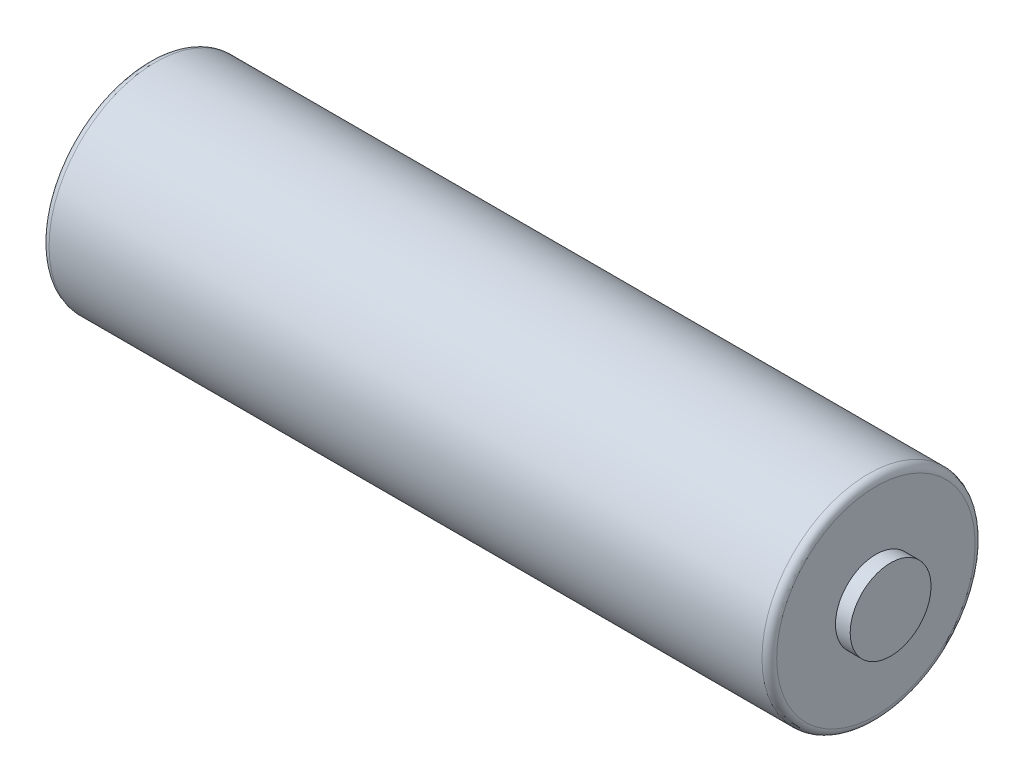
ISO-10303-21;
HEADER;
FILE_DESCRIPTION(('STEP AP214'),'2;1');
FILE_NAME('part.step','',(''),(''),'','','');
FILE_SCHEMA(('AUTOMOTIVE_DESIGN { 1 0 10303 214 1 1 1 1 }'));
ENDSEC;
DATA;
#1=APPLICATION_CONTEXT('core data for automotive mechanical design processes');
#2=APPLICATION_PROTOCOL_DEFINITION('international standard','automotive_design',2000,#1);
#3=PRODUCT_CONTEXT('',#1,'mechanical');
#4=PRODUCT('Part','Part','',(#3));
#5=PRODUCT_RELATED_PRODUCT_CATEGORY('part','',(#4));
#6=PRODUCT_DEFINITION_FORMATION('','',#4);
#7=PRODUCT_DEFINITION_CONTEXT('part definition',#1,'design');
#8=PRODUCT_DEFINITION('design','',#6,#7);
#9=PRODUCT_DEFINITION_SHAPE('','',#8);
#10=(LENGTH_UNIT() NAMED_UNIT(*) SI_UNIT(.MILLI.,.METRE.));
#11=(NAMED_UNIT(*) PLANE_ANGLE_UNIT() SI_UNIT($,.RADIAN.));
#12=(NAMED_UNIT(*) SI_UNIT($,.STERADIAN.) SOLID_ANGLE_UNIT());
#13=UNCERTAINTY_MEASURE_WITH_UNIT(LENGTH_MEASURE(1.E-05),#10,'distance_accuracy_value','');
#14=(GEOMETRIC_REPRESENTATION_CONTEXT(3) GLOBAL_UNCERTAINTY_ASSIGNED_CONTEXT((#13)) GLOBAL_UNIT_ASSIGNED_CONTEXT((#10,
#11,#12)) REPRESENTATION_CONTEXT('',''));
#15=CARTESIAN_POINT('',(0.,0.,0.));
#16=DIRECTION('',(0.,0.,1.));
#17=DIRECTION('',(1.,0.,0.));
#18=AXIS2_PLACEMENT_3D('',#15,#16,#17);
#19=CARTESIAN_POINT('',(0.,0.,0.));
#20=DIRECTION('',(1.,0.,0.));
#21=DIRECTION('',(0.,0.,-1.));
#22=AXIS2_PLACEMENT_3D('',#19,#20,#21);
#23=PLANE('',#22);
#24=CARTESIAN_POINT('',(0.,0.,0.));
#25=DIRECTION('',(1.,0.,0.));
#26=DIRECTION('',(0.,0.,-1.));
#27=AXIS2_PLACEMENT_3D('',#24,#25,#26);
#28=CIRCLE('',#27,6.75);
#29=CARTESIAN_POINT('',(0.,0.,-6.75));
#30=VERTEX_POINT('',#29);
#31=EDGE_CURVE('E10',#30,#30,#28,.F.);
#32=ORIENTED_EDGE('',*,*,#31,.T.);
#33=EDGE_LOOP('',(#32));
#34=FACE_BOUND('',#33,.T.);
#35=ADVANCED_FACE('F32',(#34),#23,.F.);
#36=CARTESIAN_POINT('',(0.,0.,0.));
#37=DIRECTION('',(-1.,0.,0.));
#38=DIRECTION('',(0.,0.,1.));
#39=AXIS2_PLACEMENT_3D('',#36,#37,#38);
#40=CYLINDRICAL_SURFACE('',#39,7.25);
#41=CARTESIAN_POINT('',(49.,0.,0.));
#42=DIRECTION('',(-1.,0.,0.));
#43=DIRECTION('',(0.,0.,1.));
#44=AXIS2_PLACEMENT_3D('',#41,#42,#43);
#45=CIRCLE('',#44,7.25);
#46=CARTESIAN_POINT('',(49.,0.,7.25));
#47=VERTEX_POINT('',#46);
#48=EDGE_CURVE('E43',#47,#47,#45,.T.);
#49=ORIENTED_EDGE('',*,*,#48,.T.);
#50=EDGE_LOOP('',(#49));
#51=FACE_BOUND('',#50,.T.);
#52=CARTESIAN_POINT('',(0.5,0.,0.));
#53=DIRECTION('',(1.,0.,0.));
#54=DIRECTION('',(0.,0.,-1.));
#55=AXIS2_PLACEMENT_3D('',#52,#53,#54);
#56=CIRCLE('',#55,7.25);
#57=CARTESIAN_POINT('',(0.5,0.,-7.25));
#58=VERTEX_POINT('',#57);
#59=EDGE_CURVE('E47',#58,#58,#56,.T.);
#60=ORIENTED_EDGE('',*,*,#59,.T.);
#61=EDGE_LOOP('',(#60));
#62=FACE_BOUND('',#61,.T.);
#63=ADVANCED_FACE('F74',(#51,#62),#40,.T.);
#64=CARTESIAN_POINT('',(49.5,7.25,0.));
#65=DIRECTION('',(-1.,0.,0.));
#66=DIRECTION('',(0.,0.,1.));
#67=AXIS2_PLACEMENT_3D('',#64,#65,#66);
#68=PLANE('',#67);
#69=CARTESIAN_POINT('',(49.5,0.,0.));
#70=DIRECTION('',(-1.,0.,0.));
#71=DIRECTION('',(0.,0.,1.));
#72=AXIS2_PLACEMENT_3D('',#69,#70,#71);
#73=CIRCLE('',#72,6.75);
#74=CARTESIAN_POINT('',(49.5,0.,6.75));
#75=VERTEX_POINT('',#74);
#76=EDGE_CURVE('E39',#75,#75,#73,.F.);
#77=ORIENTED_EDGE('',*,*,#76,.T.);
#78=EDGE_LOOP('',(#77));
#79=FACE_BOUND('',#78,.T.);
#80=CARTESIAN_POINT('',(49.5,0.,0.));
#81=DIRECTION('',(-1.,0.,0.));
#82=DIRECTION('',(0.,0.,1.));
#83=AXIS2_PLACEMENT_3D('',#80,#81,#82);
#84=CIRCLE('',#83,2.75);
#85=CARTESIAN_POINT('',(49.5,0.,2.75));
#86=VERTEX_POINT('',#85);
#87=EDGE_CURVE('E52',#86,#86,#84,.T.);
#88=ORIENTED_EDGE('',*,*,#87,.T.);
#89=EDGE_LOOP('',(#88));
#90=FACE_BOUND('',#89,.T.);
#91=ADVANCED_FACE('F70',(#79,#90),#68,.F.);
#92=CARTESIAN_POINT('',(0.,0.,0.));
#93=DIRECTION('',(-1.,0.,0.));
#94=DIRECTION('',(0.,0.,1.));
#95=AXIS2_PLACEMENT_3D('',#92,#93,#94);
#96=CYLINDRICAL_SURFACE('',#95,2.75);
#97=ORIENTED_EDGE('',*,*,#87,.F.);
#98=EDGE_LOOP('',(#97));
#99=FACE_BOUND('',#98,.T.);
#100=CARTESIAN_POINT('',(50.5,0.,0.));
#101=DIRECTION('',(-1.,0.,0.));
#102=DIRECTION('',(0.,0.,1.));
#103=AXIS2_PLACEMENT_3D('',#100,#101,#102);
#104=CIRCLE('',#103,2.75);
#105=CARTESIAN_POINT('',(50.5,0.,2.75));
#106=VERTEX_POINT('',#105);
#107=EDGE_CURVE('E55',#106,#106,#104,.T.);
#108=ORIENTED_EDGE('',*,*,#107,.T.);
#109=EDGE_LOOP('',(#108));
#110=FACE_BOUND('',#109,.T.);
#111=ADVANCED_FACE('F59',(#99,#110),#96,.T.);
#112=CARTESIAN_POINT('',(50.5,2.75,0.));
#113=DIRECTION('',(-1.,0.,0.));
#114=DIRECTION('',(0.,0.,1.));
#115=AXIS2_PLACEMENT_3D('',#112,#113,#114);
#116=PLANE('',#115);
#117=ORIENTED_EDGE('',*,*,#107,.F.);
#118=EDGE_LOOP('',(#117));
#119=FACE_BOUND('',#118,.T.);
#120=ADVANCED_FACE('F61',(#119),#116,.F.);
#121=CARTESIAN_POINT('',(49.,0.,0.));
#122=DIRECTION('',(-1.,0.,0.));
#123=DIRECTION('',(0.,0.,1.));
#124=AXIS2_PLACEMENT_3D('',#121,#122,#123);
#125=TOROIDAL_SURFACE('',#124,6.75,0.5);
#126=ORIENTED_EDGE('',*,*,#76,.F.);
#127=EDGE_LOOP('',(#126));
#128=FACE_BOUND('',#127,.T.);
#129=ORIENTED_EDGE('',*,*,#48,.F.);
#130=EDGE_LOOP('',(#129));
#131=FACE_BOUND('',#130,.T.);
#132=ADVANCED_FACE('F63',(#128,#131),#125,.T.);
#133=CARTESIAN_POINT('',(0.5,0.,0.));
#134=DIRECTION('',(1.,0.,0.));
#135=DIRECTION('',(0.,0.,-1.));
#136=AXIS2_PLACEMENT_3D('',#133,#134,#135);
#137=TOROIDAL_SURFACE('',#136,6.75,0.5);
#138=ORIENTED_EDGE('',*,*,#59,.F.);
#139=EDGE_LOOP('',(#138));
#140=FACE_BOUND('',#139,.T.);
#141=ORIENTED_EDGE('',*,*,#31,.F.);
#142=EDGE_LOOP('',(#141));
#143=FACE_BOUND('',#142,.T.);
#144=ADVANCED_FACE('F34',(#140,#143),#137,.T.);
#145=CLOSED_SHELL('',(#35,#63,#91,#111,#120,#132,#144));
#146=MANIFOLD_SOLID_BREP('B2',#145);
#147=ADVANCED_BREP_SHAPE_REPRESENTATION('',(#18,#146),#14);
#148=SHAPE_DEFINITION_REPRESENTATION(#9,#147);
ENDSEC;
END-ISO-10303-21;
